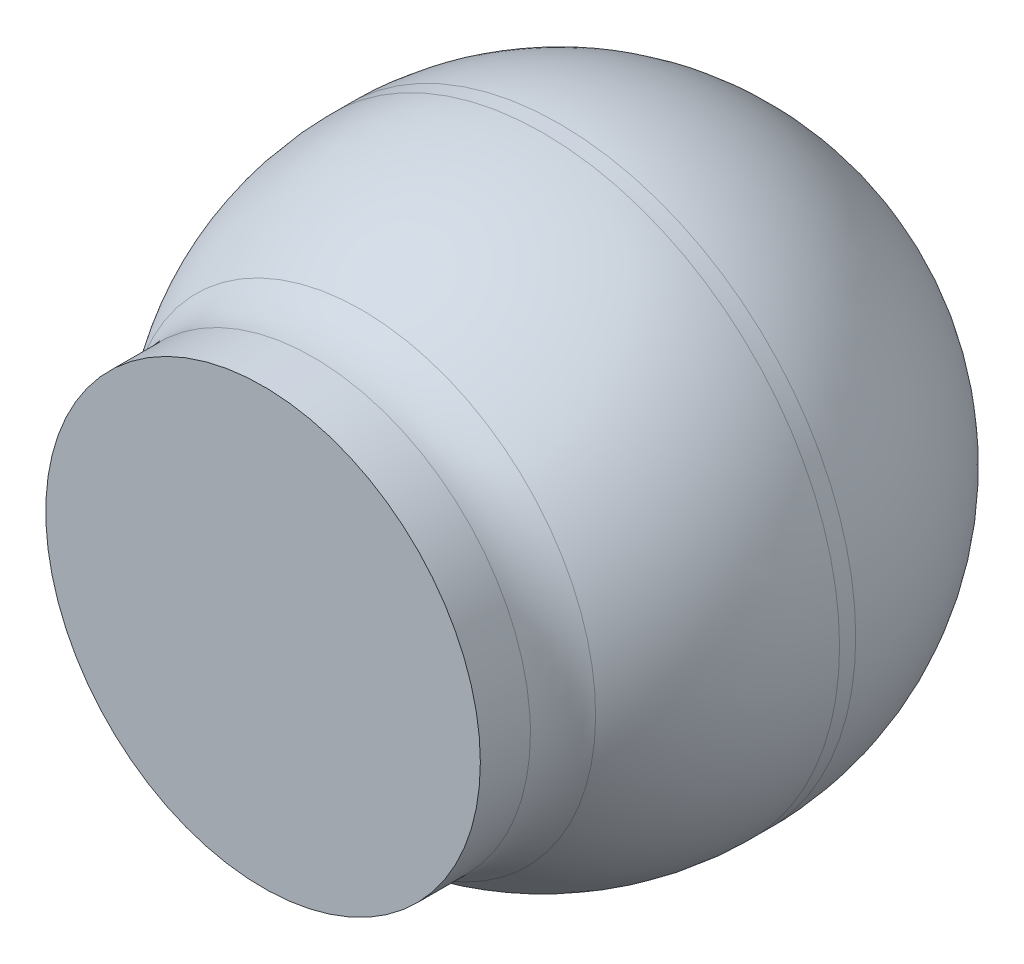
ISO-10303-21;
HEADER;
FILE_DESCRIPTION(('STEP AP214'),'2;1');
FILE_NAME('part.step','',(''),(''),'','','');
FILE_SCHEMA(('AUTOMOTIVE_DESIGN { 1 0 10303 214 1 1 1 1 }'));
ENDSEC;
DATA;
#1=APPLICATION_CONTEXT('core data for automotive mechanical design processes');
#2=APPLICATION_PROTOCOL_DEFINITION('international standard','automotive_design',2000,#1);
#3=PRODUCT_CONTEXT('',#1,'mechanical');
#4=PRODUCT('Part','Part','',(#3));
#5=PRODUCT_RELATED_PRODUCT_CATEGORY('part','',(#4));
#6=PRODUCT_DEFINITION_FORMATION('','',#4);
#7=PRODUCT_DEFINITION_CONTEXT('part definition',#1,'design');
#8=PRODUCT_DEFINITION('design','',#6,#7);
#9=PRODUCT_DEFINITION_SHAPE('','',#8);
#10=(LENGTH_UNIT() NAMED_UNIT(*) SI_UNIT(.MILLI.,.METRE.));
#11=(NAMED_UNIT(*) PLANE_ANGLE_UNIT() SI_UNIT($,.RADIAN.));
#12=(NAMED_UNIT(*) SI_UNIT($,.STERADIAN.) SOLID_ANGLE_UNIT());
#13=UNCERTAINTY_MEASURE_WITH_UNIT(LENGTH_MEASURE(1.E-05),#10,'distance_accuracy_value','');
#14=(GEOMETRIC_REPRESENTATION_CONTEXT(3) GLOBAL_UNCERTAINTY_ASSIGNED_CONTEXT((#13)) GLOBAL_UNIT_ASSIGNED_CONTEXT((#10,
#11,#12)) REPRESENTATION_CONTEXT('',''));
#15=CARTESIAN_POINT('',(0.,0.,0.));
#16=DIRECTION('',(0.,0.,1.));
#17=DIRECTION('',(1.,0.,0.));
#18=AXIS2_PLACEMENT_3D('',#15,#16,#17);
#19=CARTESIAN_POINT('',(-6.912919922269,-7.861349291452,10.006534503384));
#20=DIRECTION('',(0.,0.,-1.));
#21=DIRECTION('',(-1.,0.,0.));
#22=AXIS2_PLACEMENT_3D('',#19,#20,#21);
#23=PLANE('',#22);
#24=CARTESIAN_POINT('',(-6.912919922269,-7.861349291452,10.006534503384));
#25=DIRECTION('',(0.,0.,1.));
#26=DIRECTION('',(1.,0.,0.));
#27=AXIS2_PLACEMENT_3D('',#24,#25,#26);
#28=CIRCLE('',#27,0.275);
#29=CARTESIAN_POINT('',(-6.637919922269,-7.861349291452,10.006534503384));
#30=VERTEX_POINT('',#29);
#31=EDGE_CURVE('E20',#30,#30,#28,.F.);
#32=ORIENTED_EDGE('',*,*,#31,.F.);
#33=EDGE_LOOP('',(#32));
#34=FACE_BOUND('',#33,.T.);
#35=ADVANCED_FACE('F17',(#34),#23,.F.);
#36=CARTESIAN_POINT('',(-6.912919922269,-7.861349291452,9.906534503384));
#37=DIRECTION('',(0.,0.,1.));
#38=DIRECTION('',(1.,0.,0.));
#39=AXIS2_PLACEMENT_3D('',#36,#37,#38);
#40=CYLINDRICAL_SURFACE('',#39,0.275);
#41=CARTESIAN_POINT('',(-6.912919922269,-7.861349291452,9.943180457728));
#42=DIRECTION('',(0.,0.,-1.));
#43=DIRECTION('',(0.996700902337582,0.081162252799247,0.));
#44=AXIS2_PLACEMENT_3D('',#41,#42,#43);
#45=CIRCLE('',#44,0.275);
#46=CARTESIAN_POINT('',(-6.63882717412617,-7.83902967193221,9.943180457728));
#47=VERTEX_POINT('',#46);
#48=EDGE_CURVE('E65',#47,#47,#45,.F.);
#49=ORIENTED_EDGE('',*,*,#48,.T.);
#50=EDGE_LOOP('',(#49));
#51=FACE_BOUND('',#50,.T.);
#52=ORIENTED_EDGE('',*,*,#31,.T.);
#53=EDGE_LOOP('',(#52));
#54=FACE_BOUND('',#53,.T.);
#55=ADVANCED_FACE('F62',(#51,#54),#40,.T.);
#56=CARTESIAN_POINT('',(-6.912919922269,-7.861349291452,9.943180457728));
#57=DIRECTION('',(0.,0.,-1.));
#58=DIRECTION('',(0.996700902337583,0.0811622527992448,0.));
#59=AXIS2_PLACEMENT_3D('',#56,#57,#58);
#60=TOROIDAL_SURFACE('',#59,0.375,0.1);
#61=ORIENTED_EDGE('',*,*,#48,.F.);
#62=EDGE_LOOP('',(#61));
#63=FACE_BOUND('',#62,.T.);
#64=CARTESIAN_POINT('',(-6.912919922269,-7.861349291452,9.881744931236));
#65=DIRECTION('',(0.,0.,-1.));
#66=DIRECTION('',(-0.996700902337598,-0.0811622527990622,0.));
#67=AXIS2_PLACEMENT_3D('',#64,#65,#66);
#68=CIRCLE('',#67,0.296097046412665);
#69=CARTESIAN_POINT('',(-7.208040115608,-7.885381194786,9.881744931236));
#70=VERTEX_POINT('',#69);
#71=EDGE_CURVE('E39',#70,#70,#68,.T.);
#72=ORIENTED_EDGE('',*,*,#71,.F.);
#73=EDGE_LOOP('',(#72));
#74=FACE_BOUND('',#73,.T.);
#75=ADVANCED_FACE('F57',(#63,#74),#60,.F.);
#76=CARTESIAN_POINT('',(-7.286682760645,-7.891785136252,9.651976062157));
#77=CARTESIAN_POINT('',(-7.286682760645,-7.891785136252,9.701461392103));
#78=CARTESIAN_POINT('',(-7.278526217348,-7.891120941579,9.750947004335));
#79=CARTESIAN_POINT('',(-7.262207085349,-7.889792059952,9.798626332798));
#80=CARTESIAN_POINT('',(-7.238341390838,-7.887848654938,9.842699544317));
#81=CARTESIAN_POINT('',(-7.208040115608,-7.885381194786,9.881744931236));
#82=(BOUNDED_CURVE() B_SPLINE_CURVE(5,(#76,#77,#78,#79,#80,#81),.UNSPECIFIED.,.F.,
.F.) B_SPLINE_CURVE_WITH_KNOTS((6,6),(0.,0.661568582165),
.UNSPECIFIED.) CURVE() GEOMETRIC_REPRESENTATION_ITEM() RATIONAL_B_SPLINE_CURVE((1.,1.,1.,1.,1.,1.)) REPRESENTATION_ITEM(''));
#83=CARTESIAN_POINT('',(-6.912919922269,-7.861349291452,9.651976062157));
#84=DIRECTION('',(0.,0.,-1.));
#85=AXIS1_PLACEMENT('',#83,#84);
#86=SURFACE_OF_REVOLUTION('',#82,#85);
#87=CARTESIAN_POINT('',(-6.912919922269,-7.861349291452,9.651976062157));
#88=DIRECTION('',(0.,0.,1.));
#89=DIRECTION('',(1.,0.,0.));
#90=AXIS2_PLACEMENT_3D('',#87,#88,#89);
#91=CIRCLE('',#90,0.375);
#92=CARTESIAN_POINT('',(-6.537919922269,-7.861349291452,9.651976062157));
#93=VERTEX_POINT('',#92);
#94=EDGE_CURVE('E36',#93,#93,#91,.F.);
#95=ORIENTED_EDGE('',*,*,#94,.F.);
#96=EDGE_LOOP('',(#95));
#97=FACE_BOUND('',#96,.T.);
#98=ORIENTED_EDGE('',*,*,#71,.T.);
#99=EDGE_LOOP('',(#98));
#100=FACE_BOUND('',#99,.T.);
#101=ADVANCED_FACE('F53',(#97,#100),#86,.F.);
#102=CARTESIAN_POINT('',(-6.912919922269,-7.861349291452,9.256534503384));
#103=DIRECTION('',(0.,0.,1.));
#104=DIRECTION('',(1.,0.,0.));
#105=AXIS2_PLACEMENT_3D('',#102,#103,#104);
#106=CYLINDRICAL_SURFACE('',#105,0.375);
#107=CARTESIAN_POINT('',(-6.912919922269,-7.861349291452,9.631534503384));
#108=DIRECTION('',(0.,0.,-1.));
#109=DIRECTION('',(0.0811622527992357,-0.996700902337583,0.));
#110=AXIS2_PLACEMENT_3D('',#107,#108,#109);
#111=CIRCLE('',#110,0.375);
#112=CARTESIAN_POINT('',(-6.88248407746929,-8.23511212982859,9.631534503384));
#113=VERTEX_POINT('',#112);
#114=CARTESIAN_POINT('',(-6.94335576706871,-7.48758645307541,9.631534503384));
#115=VERTEX_POINT('',#114);
#116=EDGE_CURVE('E11',#113,#115,#111,.T.);
#117=ORIENTED_EDGE('',*,*,#116,.F.);
#118=CARTESIAN_POINT('',(-6.912919922269,-7.861349291452,9.631534503384));
#119=DIRECTION('',(0.,0.,1.));
#120=DIRECTION('',(0.0811622527992365,-0.996700902337583,0.));
#121=AXIS2_PLACEMENT_3D('',#118,#119,#120);
#122=CIRCLE('',#121,0.375);
#123=EDGE_CURVE('E25',#115,#113,#122,.F.);
#124=ORIENTED_EDGE('',*,*,#123,.F.);
#125=EDGE_LOOP('',(#117,#124));
#126=FACE_BOUND('',#125,.T.);
#127=ORIENTED_EDGE('',*,*,#94,.T.);
#128=EDGE_LOOP('',(#127));
#129=FACE_BOUND('',#128,.T.);
#130=ADVANCED_FACE('F34',(#126,#129),#106,.T.);
#131=CARTESIAN_POINT('',(-6.912919922269,-7.861349291452,9.631534503384));
#132=DIRECTION('',(0.0811622527992361,-0.996700902337583,0.));
#133=DIRECTION('',(-0.996700902337583,-0.0811622527992361,0.));
#134=AXIS2_PLACEMENT_3D('',#131,#132,#133);
#135=SPHERICAL_SURFACE('',#134,0.375);
#136=ORIENTED_EDGE('',*,*,#123,.T.);
#137=ORIENTED_EDGE('',*,*,#116,.T.);
#138=EDGE_LOOP('',(#136,#137));
#139=FACE_BOUND('',#138,.T.);
#140=ADVANCED_FACE('F32',(#139),#135,.T.);
#141=CLOSED_SHELL('',(#35,#55,#75,#101,#130,#140));
#142=MANIFOLD_SOLID_BREP('B1',#141);
#143=ADVANCED_BREP_SHAPE_REPRESENTATION('',(#18,#142),#14);
#144=SHAPE_DEFINITION_REPRESENTATION(#9,#143);
ENDSEC;
END-ISO-10303-21;
